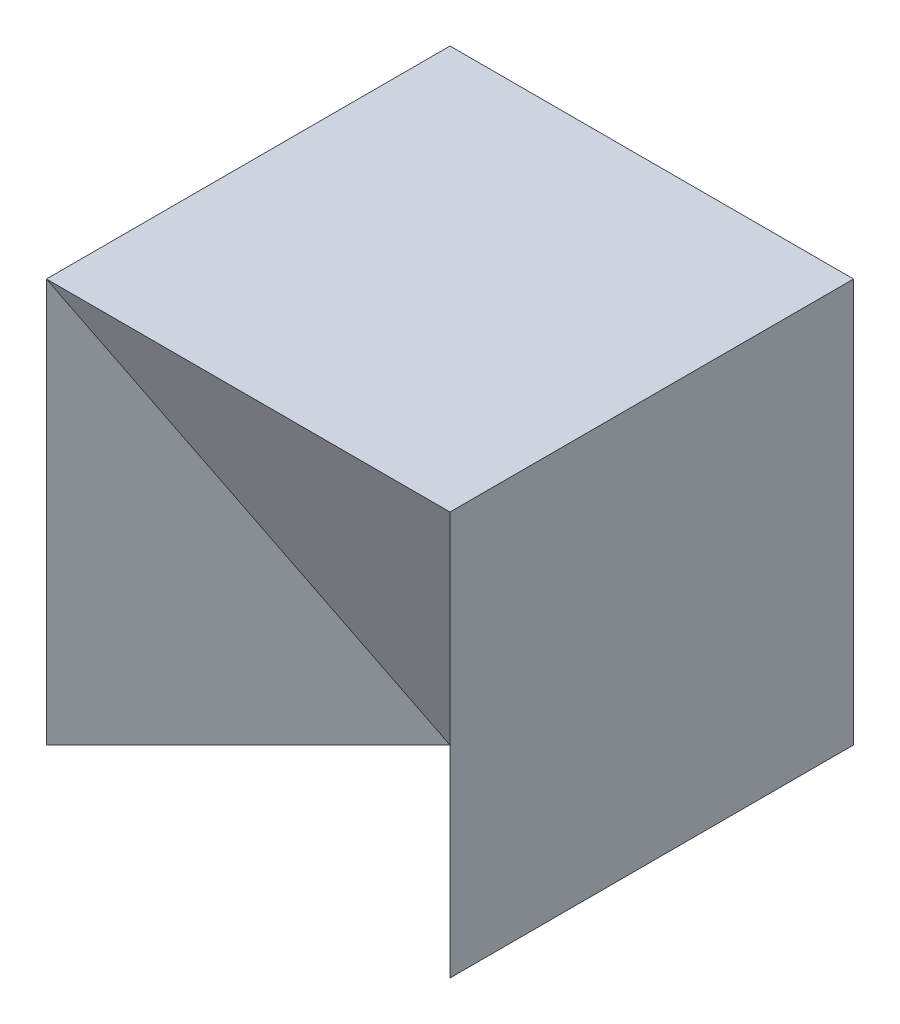
ISO-10303-21;
HEADER;
FILE_DESCRIPTION(('STEP AP214'),'2;1');
FILE_NAME('part.step','',(''),(''),'','','');
FILE_SCHEMA(('AUTOMOTIVE_DESIGN { 1 0 10303 214 1 1 1 1 }'));
ENDSEC;
DATA;
#1=APPLICATION_CONTEXT('core data for automotive mechanical design processes');
#2=APPLICATION_PROTOCOL_DEFINITION('international standard','automotive_design',2000,#1);
#3=PRODUCT_CONTEXT('',#1,'mechanical');
#4=PRODUCT('Part','Part','',(#3));
#5=PRODUCT_RELATED_PRODUCT_CATEGORY('part','',(#4));
#6=PRODUCT_DEFINITION_FORMATION('','',#4);
#7=PRODUCT_DEFINITION_CONTEXT('part definition',#1,'design');
#8=PRODUCT_DEFINITION('design','',#6,#7);
#9=PRODUCT_DEFINITION_SHAPE('','',#8);
#10=(LENGTH_UNIT() NAMED_UNIT(*) SI_UNIT(.MILLI.,.METRE.));
#11=(NAMED_UNIT(*) PLANE_ANGLE_UNIT() SI_UNIT($,.RADIAN.));
#12=(NAMED_UNIT(*) SI_UNIT($,.STERADIAN.) SOLID_ANGLE_UNIT());
#13=UNCERTAINTY_MEASURE_WITH_UNIT(LENGTH_MEASURE(1.E-05),#10,'distance_accuracy_value','');
#14=(GEOMETRIC_REPRESENTATION_CONTEXT(3) GLOBAL_UNCERTAINTY_ASSIGNED_CONTEXT((#13)) GLOBAL_UNIT_ASSIGNED_CONTEXT((#10,
#11,#12)) REPRESENTATION_CONTEXT('',''));
#15=CARTESIAN_POINT('',(0.,0.,0.));
#16=DIRECTION('',(0.,0.,1.));
#17=DIRECTION('',(1.,0.,0.));
#18=AXIS2_PLACEMENT_3D('',#15,#16,#17);
#19=CARTESIAN_POINT('',(2.,4.,2.));
#20=DIRECTION('',(-1.,0.,0.));
#21=DIRECTION('',(0.,0.,1.));
#22=AXIS2_PLACEMENT_3D('',#19,#20,#21);
#23=PLANE('',#22);
#24=DIRECTION('',(0.,0.,-1.));
#25=VECTOR('',#24,1.);
#26=CARTESIAN_POINT('',(2.,0.,2.));
#27=LINE('',#26,#25);
#28=CARTESIAN_POINT('',(2.,0.,2.));
#29=VERTEX_POINT('',#28);
#30=CARTESIAN_POINT('',(2.,0.,-2.));
#31=VERTEX_POINT('',#30);
#32=EDGE_CURVE('E97',#29,#31,#27,.T.);
#33=ORIENTED_EDGE('',*,*,#32,.T.);
#34=DIRECTION('',(0.,-1.,0.));
#35=VECTOR('',#34,1.);
#36=CARTESIAN_POINT('',(2.,4.,-2.));
#37=LINE('',#36,#35);
#38=CARTESIAN_POINT('',(2.,4.,-2.));
#39=VERTEX_POINT('',#38);
#40=EDGE_CURVE('E91',#39,#31,#37,.T.);
#41=ORIENTED_EDGE('',*,*,#40,.F.);
#42=DIRECTION('',(0.,0.,-1.));
#43=VECTOR('',#42,1.);
#44=CARTESIAN_POINT('',(2.,4.,2.));
#45=LINE('',#44,#43);
#46=CARTESIAN_POINT('',(2.,4.,2.));
#47=VERTEX_POINT('',#46);
#48=EDGE_CURVE('E94',#47,#39,#45,.T.);
#49=ORIENTED_EDGE('',*,*,#48,.F.);
#50=DIRECTION('',(0.,-1.,0.));
#51=VECTOR('',#50,1.);
#52=CARTESIAN_POINT('',(2.,4.,2.));
#53=LINE('',#52,#51);
#54=EDGE_CURVE('E84',#47,#29,#53,.T.);
#55=ORIENTED_EDGE('',*,*,#54,.T.);
#56=EDGE_LOOP('',(#33,#41,#49,#55));
#57=FACE_BOUND('',#56,.T.);
#58=ADVANCED_FACE('F34',(#57),#23,.F.);
#59=CARTESIAN_POINT('',(-2.,4.,-2.));
#60=DIRECTION('',(0.,0.,1.));
#61=DIRECTION('',(1.,0.,0.));
#62=AXIS2_PLACEMENT_3D('',#59,#60,#61);
#63=PLANE('',#62);
#64=DIRECTION('',(-1.,0.,0.));
#65=VECTOR('',#64,1.);
#66=CARTESIAN_POINT('',(-2.,0.,-2.));
#67=LINE('',#66,#65);
#68=CARTESIAN_POINT('',(-2.,0.,-2.));
#69=VERTEX_POINT('',#68);
#70=EDGE_CURVE('E64',#31,#69,#67,.T.);
#71=ORIENTED_EDGE('',*,*,#70,.T.);
#72=DIRECTION('',(0.,-1.,0.));
#73=VECTOR('',#72,1.);
#74=CARTESIAN_POINT('',(-2.,4.,-2.));
#75=LINE('',#74,#73);
#76=CARTESIAN_POINT('',(-2.,4.,-2.));
#77=VERTEX_POINT('',#76);
#78=EDGE_CURVE('E83',#77,#69,#75,.T.);
#79=ORIENTED_EDGE('',*,*,#78,.F.);
#80=DIRECTION('',(-1.,0.,0.));
#81=VECTOR('',#80,1.);
#82=CARTESIAN_POINT('',(-2.,4.,-2.));
#83=LINE('',#82,#81);
#84=EDGE_CURVE('E52',#39,#77,#83,.T.);
#85=ORIENTED_EDGE('',*,*,#84,.F.);
#86=ORIENTED_EDGE('',*,*,#40,.T.);
#87=EDGE_LOOP('',(#71,#79,#85,#86));
#88=FACE_BOUND('',#87,.T.);
#89=ADVANCED_FACE('F141',(#88),#63,.F.);
#90=CARTESIAN_POINT('',(-2.,4.,2.));
#91=DIRECTION('',(1.,0.,0.));
#92=DIRECTION('',(0.,0.,-1.));
#93=AXIS2_PLACEMENT_3D('',#90,#91,#92);
#94=PLANE('',#93);
#95=DIRECTION('',(0.,0.,1.));
#96=VECTOR('',#95,1.);
#97=CARTESIAN_POINT('',(-2.,0.,2.));
#98=LINE('',#97,#96);
#99=CARTESIAN_POINT('',(-2.,0.,2.));
#100=VERTEX_POINT('',#99);
#101=EDGE_CURVE('E89',#69,#100,#98,.T.);
#102=ORIENTED_EDGE('',*,*,#101,.T.);
#103=DIRECTION('',(0.,-1.,0.));
#104=VECTOR('',#103,1.);
#105=CARTESIAN_POINT('',(-2.,4.,2.));
#106=LINE('',#105,#104);
#107=CARTESIAN_POINT('',(-2.,4.,2.));
#108=VERTEX_POINT('',#107);
#109=EDGE_CURVE('E71',#108,#100,#106,.T.);
#110=ORIENTED_EDGE('',*,*,#109,.F.);
#111=DIRECTION('',(0.,0.,1.));
#112=VECTOR('',#111,1.);
#113=CARTESIAN_POINT('',(-2.,4.,2.));
#114=LINE('',#113,#112);
#115=EDGE_CURVE('E114',#77,#108,#114,.T.);
#116=ORIENTED_EDGE('',*,*,#115,.F.);
#117=ORIENTED_EDGE('',*,*,#78,.T.);
#118=EDGE_LOOP('',(#102,#110,#116,#117));
#119=FACE_BOUND('',#118,.T.);
#120=ADVANCED_FACE('F93',(#119),#94,.F.);
#121=CARTESIAN_POINT('',(0.,4.,0.));
#122=DIRECTION('',(0.,-1.,0.));
#123=DIRECTION('',(0.,0.,-1.));
#124=AXIS2_PLACEMENT_3D('',#121,#122,#123);
#125=PLANE('',#124);
#126=ORIENTED_EDGE('',*,*,#48,.T.);
#127=ORIENTED_EDGE('',*,*,#84,.T.);
#128=ORIENTED_EDGE('',*,*,#115,.T.);
#129=DIRECTION('',(1.,0.,0.));
#130=VECTOR('',#129,1.);
#131=CARTESIAN_POINT('',(-2.,4.,2.));
#132=LINE('',#131,#130);
#133=EDGE_CURVE('E109',#108,#47,#132,.T.);
#134=ORIENTED_EDGE('',*,*,#133,.T.);
#135=EDGE_LOOP('',(#126,#127,#128,#134));
#136=FACE_BOUND('',#135,.T.);
#137=ADVANCED_FACE('F140',(#136),#125,.F.);
#138=CARTESIAN_POINT('',(0.,0.,0.));
#139=DIRECTION('',(0.,-1.,0.));
#140=DIRECTION('',(0.,0.,-1.));
#141=AXIS2_PLACEMENT_3D('',#138,#139,#140);
#142=PLANE('',#141);
#143=DIRECTION('',(0.707106781186548,0.,0.707106781186548));
#144=VECTOR('',#143,1.);
#145=CARTESIAN_POINT('',(0.,0.,0.));
#146=LINE('',#145,#144);
#147=CARTESIAN_POINT('',(0.,0.,0.));
#148=VERTEX_POINT('',#147);
#149=EDGE_CURVE('E12',#148,#29,#146,.T.);
#150=ORIENTED_EDGE('',*,*,#149,.F.);
#151=DIRECTION('',(0.707106781186547,0.,-0.707106781186548));
#152=VECTOR('',#151,1.);
#153=CARTESIAN_POINT('',(0.,0.,0.));
#154=LINE('',#153,#152);
#155=EDGE_CURVE('E43',#100,#148,#154,.T.);
#156=ORIENTED_EDGE('',*,*,#155,.F.);
#157=ORIENTED_EDGE('',*,*,#101,.F.);
#158=ORIENTED_EDGE('',*,*,#70,.F.);
#159=ORIENTED_EDGE('',*,*,#32,.F.);
#160=EDGE_LOOP('',(#150,#156,#157,#158,#159));
#161=FACE_BOUND('',#160,.T.);
#162=ADVANCED_FACE('F88',(#161),#142,.T.);
#163=CARTESIAN_POINT('',(0.,0.,0.));
#164=DIRECTION('',(0.,-0.447213595499958,0.894427190999916));
#165=DIRECTION('',(0.,-0.894427190999916,-0.447213595499958));
#166=AXIS2_PLACEMENT_3D('',#163,#164,#165);
#167=PLANE('',#166);
#168=DIRECTION('',(0.408248290463863,0.816496580927726,0.408248290463863));
#169=VECTOR('',#168,1.);
#170=CARTESIAN_POINT('',(0.,0.,0.));
#171=LINE('',#170,#169);
#172=EDGE_CURVE('E128',#148,#47,#171,.T.);
#173=ORIENTED_EDGE('',*,*,#172,.T.);
#174=ORIENTED_EDGE('',*,*,#133,.F.);
#175=DIRECTION('',(0.408248290463863,-0.816496580927726,-0.408248290463863));
#176=VECTOR('',#175,1.);
#177=CARTESIAN_POINT('',(-2.,4.,2.));
#178=LINE('',#177,#176);
#179=EDGE_CURVE('E78',#108,#148,#178,.T.);
#180=ORIENTED_EDGE('',*,*,#179,.T.);
#181=EDGE_LOOP('',(#173,#174,#180));
#182=FACE_BOUND('',#181,.T.);
#183=ADVANCED_FACE('F135',(#182),#167,.T.);
#184=CARTESIAN_POINT('',(0.,0.,0.));
#185=DIRECTION('',(0.707106781186548,0.,-0.707106781186548));
#186=DIRECTION('',(-0.707106781186548,0.,-0.707106781186548));
#187=AXIS2_PLACEMENT_3D('',#184,#185,#186);
#188=PLANE('',#187);
#189=ORIENTED_EDGE('',*,*,#149,.T.);
#190=ORIENTED_EDGE('',*,*,#54,.F.);
#191=ORIENTED_EDGE('',*,*,#172,.F.);
#192=EDGE_LOOP('',(#189,#190,#191));
#193=FACE_BOUND('',#192,.T.);
#194=ADVANCED_FACE('F155',(#193),#188,.F.);
#195=CARTESIAN_POINT('',(-2.,4.,2.));
#196=DIRECTION('',(-0.707106781186548,0.,-0.707106781186547));
#197=DIRECTION('',(-0.707106781186547,0.,0.707106781186548));
#198=AXIS2_PLACEMENT_3D('',#195,#196,#197);
#199=PLANE('',#198);
#200=ORIENTED_EDGE('',*,*,#155,.T.);
#201=ORIENTED_EDGE('',*,*,#179,.F.);
#202=ORIENTED_EDGE('',*,*,#109,.T.);
#203=EDGE_LOOP('',(#200,#201,#202));
#204=FACE_BOUND('',#203,.T.);
#205=ADVANCED_FACE('F73',(#204),#199,.F.);
#206=CLOSED_SHELL('',(#58,#89,#120,#137,#162,#183,#194,#205));
#207=MANIFOLD_SOLID_BREP('B2',#206);
#208=ADVANCED_BREP_SHAPE_REPRESENTATION('',(#18,#207),#14);
#209=SHAPE_DEFINITION_REPRESENTATION(#9,#208);
ENDSEC;
END-ISO-10303-21;
